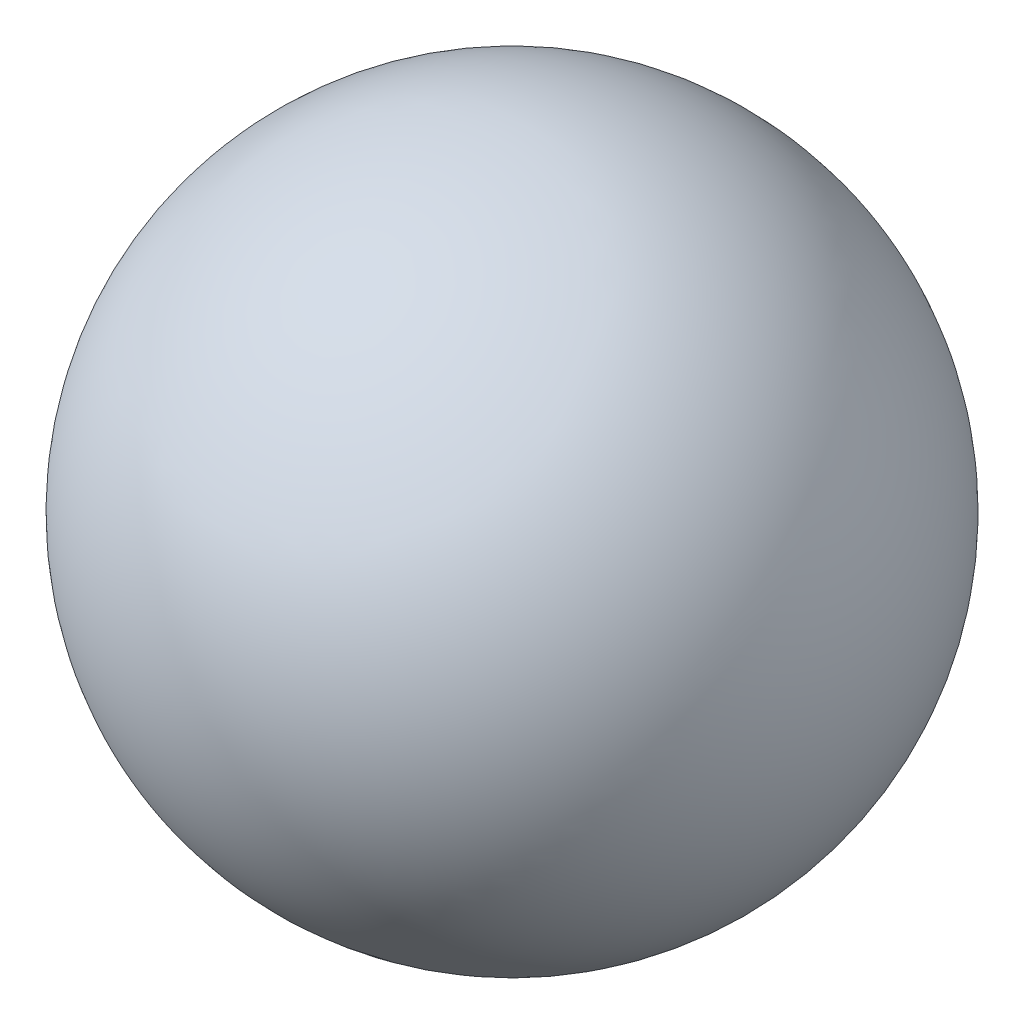
ISO-10303-21;
HEADER;
FILE_DESCRIPTION(('STEP AP214'),'2;1');
FILE_NAME('part.step','',(''),(''),'','','');
FILE_SCHEMA(('AUTOMOTIVE_DESIGN { 1 0 10303 214 1 1 1 1 }'));
ENDSEC;
DATA;
#1=APPLICATION_CONTEXT('core data for automotive mechanical design processes');
#2=APPLICATION_PROTOCOL_DEFINITION('international standard','automotive_design',2000,#1);
#3=PRODUCT_CONTEXT('',#1,'mechanical');
#4=PRODUCT('Part','Part','',(#3));
#5=PRODUCT_RELATED_PRODUCT_CATEGORY('part','',(#4));
#6=PRODUCT_DEFINITION_FORMATION('','',#4);
#7=PRODUCT_DEFINITION_CONTEXT('part definition',#1,'design');
#8=PRODUCT_DEFINITION('design','',#6,#7);
#9=PRODUCT_DEFINITION_SHAPE('','',#8);
#10=(LENGTH_UNIT() NAMED_UNIT(*) SI_UNIT(.MILLI.,.METRE.));
#11=(NAMED_UNIT(*) PLANE_ANGLE_UNIT() SI_UNIT($,.RADIAN.));
#12=(NAMED_UNIT(*) SI_UNIT($,.STERADIAN.) SOLID_ANGLE_UNIT());
#13=UNCERTAINTY_MEASURE_WITH_UNIT(LENGTH_MEASURE(1.E-05),#10,'distance_accuracy_value','');
#14=(GEOMETRIC_REPRESENTATION_CONTEXT(3) GLOBAL_UNCERTAINTY_ASSIGNED_CONTEXT((#13)) GLOBAL_UNIT_ASSIGNED_CONTEXT((#10,
#11,#12)) REPRESENTATION_CONTEXT('',''));
#15=CARTESIAN_POINT('',(0.,0.,0.));
#16=DIRECTION('',(0.,0.,1.));
#17=DIRECTION('',(1.,0.,0.));
#18=AXIS2_PLACEMENT_3D('',#15,#16,#17);
#19=CARTESIAN_POINT('',(64.16,-10.0471246789676,68.6517004500637));
#20=DIRECTION('',(0.,-0.144806720363312,0.989459960654104));
#21=DIRECTION('',(0.173648177666934,-0.974427840547316,-0.14260678090206));
#22=AXIS2_PLACEMENT_3D('',#19,#20,#21);
#23=SPHERICAL_SURFACE('',#22,7.15);
#24=CARTESIAN_POINT('',(64.16,-9.01175662836992,61.5770617313869));
#25=VERTEX_POINT('',#24);
#26=VERTEX_LOOP('',#25);
#27=FACE_BOUND('',#26,.T.);
#28=CARTESIAN_POINT('',(64.16,-11.0824927295653,75.7263391687406));
#29=VERTEX_POINT('',#28);
#30=VERTEX_LOOP('',#29);
#31=FACE_BOUND('',#30,.T.);
#32=ADVANCED_FACE('F16',(#27,#31),#23,.T.);
#33=CLOSED_SHELL('',(#32));
#34=MANIFOLD_SOLID_BREP('B1',#33);
#35=ADVANCED_BREP_SHAPE_REPRESENTATION('',(#18,#34),#14);
#36=SHAPE_DEFINITION_REPRESENTATION(#9,#35);
ENDSEC;
END-ISO-10303-21;
